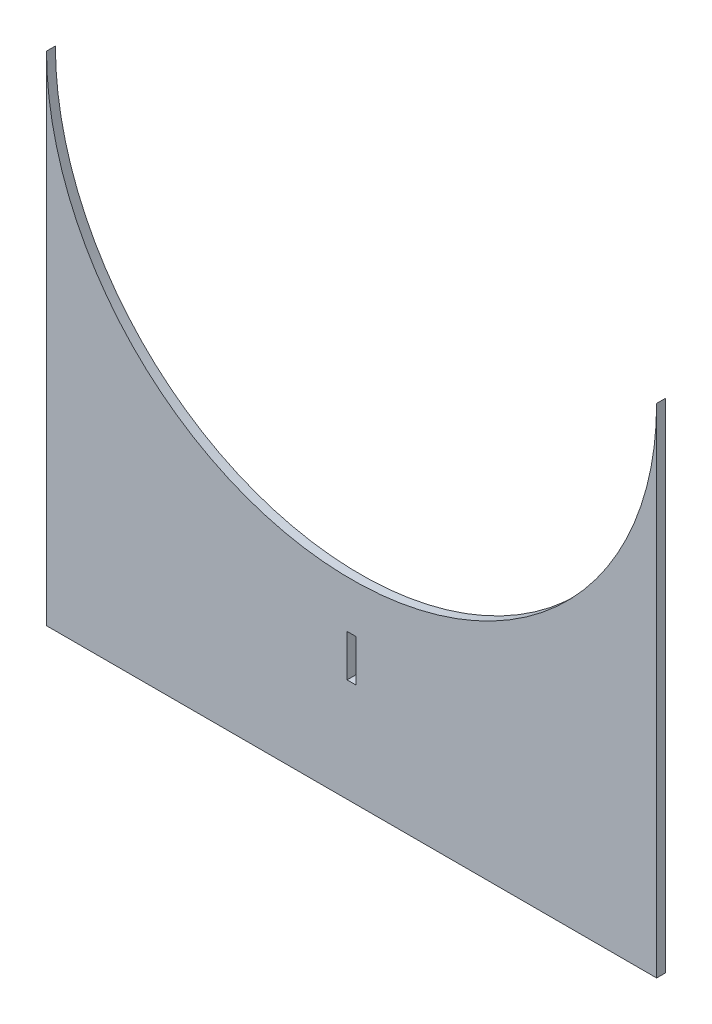
ISO-10303-21;
HEADER;
FILE_DESCRIPTION(('STEP AP214'),'2;1');
FILE_NAME('part.step','',(''),(''),'','','');
FILE_SCHEMA(('AUTOMOTIVE_DESIGN { 1 0 10303 214 1 1 1 1 }'));
ENDSEC;
DATA;
#1=APPLICATION_CONTEXT('core data for automotive mechanical design processes');
#2=APPLICATION_PROTOCOL_DEFINITION('international standard','automotive_design',2000,#1);
#3=PRODUCT_CONTEXT('',#1,'mechanical');
#4=PRODUCT('Part','Part','',(#3));
#5=PRODUCT_RELATED_PRODUCT_CATEGORY('part','',(#4));
#6=PRODUCT_DEFINITION_FORMATION('','',#4);
#7=PRODUCT_DEFINITION_CONTEXT('part definition',#1,'design');
#8=PRODUCT_DEFINITION('design','',#6,#7);
#9=PRODUCT_DEFINITION_SHAPE('','',#8);
#10=(LENGTH_UNIT() NAMED_UNIT(*) SI_UNIT(.MILLI.,.METRE.));
#11=(NAMED_UNIT(*) PLANE_ANGLE_UNIT() SI_UNIT($,.RADIAN.));
#12=(NAMED_UNIT(*) SI_UNIT($,.STERADIAN.) SOLID_ANGLE_UNIT());
#13=UNCERTAINTY_MEASURE_WITH_UNIT(LENGTH_MEASURE(1.E-05),#10,'distance_accuracy_value','');
#14=(GEOMETRIC_REPRESENTATION_CONTEXT(3) GLOBAL_UNCERTAINTY_ASSIGNED_CONTEXT((#13)) GLOBAL_UNIT_ASSIGNED_CONTEXT((#10,
#11,#12)) REPRESENTATION_CONTEXT('',''));
#15=CARTESIAN_POINT('',(0.,0.,0.));
#16=DIRECTION('',(0.,0.,1.));
#17=DIRECTION('',(1.,0.,0.));
#18=AXIS2_PLACEMENT_3D('',#15,#16,#17);
#19=CARTESIAN_POINT('',(0.,88.9,3.175));
#20=DIRECTION('',(0.,0.,-1.));
#21=DIRECTION('',(-1.,0.,0.));
#22=AXIS2_PLACEMENT_3D('',#19,#20,#21);
#23=CYLINDRICAL_SURFACE('',#22,109.);
#24=CARTESIAN_POINT('',(0.,88.9,0.));
#25=DIRECTION('',(0.,0.,1.));
#26=DIRECTION('',(1.,0.,0.));
#27=AXIS2_PLACEMENT_3D('',#24,#25,#26);
#28=CIRCLE('',#27,109.);
#29=CARTESIAN_POINT('',(-109.,88.9,0.));
#30=VERTEX_POINT('',#29);
#31=CARTESIAN_POINT('',(109.,88.9,0.));
#32=VERTEX_POINT('',#31);
#33=EDGE_CURVE('E148',#30,#32,#28,.T.);
#34=ORIENTED_EDGE('',*,*,#33,.F.);
#35=DIRECTION('',(0.,0.,-1.));
#36=VECTOR('',#35,1.);
#37=CARTESIAN_POINT('',(-109.,88.9,3.175));
#38=LINE('',#37,#36);
#39=CARTESIAN_POINT('',(-109.,88.9,3.175));
#40=VERTEX_POINT('',#39);
#41=EDGE_CURVE('E11',#40,#30,#38,.T.);
#42=ORIENTED_EDGE('',*,*,#41,.F.);
#43=CARTESIAN_POINT('',(0.,88.9,3.175));
#44=DIRECTION('',(0.,0.,1.));
#45=DIRECTION('',(1.,0.,0.));
#46=AXIS2_PLACEMENT_3D('',#43,#44,#45);
#47=CIRCLE('',#46,109.);
#48=CARTESIAN_POINT('',(109.,88.9,3.175));
#49=VERTEX_POINT('',#48);
#50=EDGE_CURVE('E154',#40,#49,#47,.T.);
#51=ORIENTED_EDGE('',*,*,#50,.T.);
#52=DIRECTION('',(0.,0.,-1.));
#53=VECTOR('',#52,1.);
#54=CARTESIAN_POINT('',(109.,88.9,3.175));
#55=LINE('',#54,#53);
#56=EDGE_CURVE('E169',#49,#32,#55,.T.);
#57=ORIENTED_EDGE('',*,*,#56,.T.);
#58=EDGE_LOOP('',(#34,#42,#51,#57));
#59=FACE_BOUND('',#58,.T.);
#60=ADVANCED_FACE('F41',(#59),#23,.F.);
#61=CARTESIAN_POINT('',(-109.,0.,3.175));
#62=DIRECTION('',(-1.,0.,0.));
#63=DIRECTION('',(0.,0.,1.));
#64=AXIS2_PLACEMENT_3D('',#61,#62,#63);
#65=PLANE('',#64);
#66=DIRECTION('',(0.,1.,0.));
#67=VECTOR('',#66,1.);
#68=CARTESIAN_POINT('',(-109.,0.,0.));
#69=LINE('',#68,#67);
#70=CARTESIAN_POINT('',(-109.,-88.9,0.));
#71=VERTEX_POINT('',#70);
#72=EDGE_CURVE('E173',#71,#30,#69,.T.);
#73=ORIENTED_EDGE('',*,*,#72,.F.);
#74=DIRECTION('',(0.,0.,-1.));
#75=VECTOR('',#74,1.);
#76=CARTESIAN_POINT('',(-109.,-88.9,3.175));
#77=LINE('',#76,#75);
#78=CARTESIAN_POINT('',(-109.,-88.9,3.175));
#79=VERTEX_POINT('',#78);
#80=EDGE_CURVE('E49',#79,#71,#77,.T.);
#81=ORIENTED_EDGE('',*,*,#80,.F.);
#82=DIRECTION('',(0.,1.,0.));
#83=VECTOR('',#82,1.);
#84=CARTESIAN_POINT('',(-109.,0.,3.175));
#85=LINE('',#84,#83);
#86=EDGE_CURVE('E158',#79,#40,#85,.T.);
#87=ORIENTED_EDGE('',*,*,#86,.T.);
#88=ORIENTED_EDGE('',*,*,#41,.T.);
#89=EDGE_LOOP('',(#73,#81,#87,#88));
#90=FACE_BOUND('',#89,.T.);
#91=ADVANCED_FACE('F200',(#90),#65,.T.);
#92=CARTESIAN_POINT('',(0.,-88.9,3.175));
#93=DIRECTION('',(0.,1.,0.));
#94=DIRECTION('',(0.,0.,1.));
#95=AXIS2_PLACEMENT_3D('',#92,#93,#94);
#96=PLANE('',#95);
#97=DIRECTION('',(1.,0.,0.));
#98=VECTOR('',#97,1.);
#99=CARTESIAN_POINT('',(0.,-88.9,0.));
#100=LINE('',#99,#98);
#101=CARTESIAN_POINT('',(109.,-88.9,0.));
#102=VERTEX_POINT('',#101);
#103=EDGE_CURVE('E177',#71,#102,#100,.T.);
#104=ORIENTED_EDGE('',*,*,#103,.T.);
#105=DIRECTION('',(0.,0.,-1.));
#106=VECTOR('',#105,1.);
#107=CARTESIAN_POINT('',(109.,-88.9,3.175));
#108=LINE('',#107,#106);
#109=CARTESIAN_POINT('',(109.,-88.9,3.175));
#110=VERTEX_POINT('',#109);
#111=EDGE_CURVE('E185',#110,#102,#108,.T.);
#112=ORIENTED_EDGE('',*,*,#111,.F.);
#113=DIRECTION('',(1.,0.,0.));
#114=VECTOR('',#113,1.);
#115=CARTESIAN_POINT('',(0.,-88.9,3.175));
#116=LINE('',#115,#114);
#117=EDGE_CURVE('E163',#79,#110,#116,.T.);
#118=ORIENTED_EDGE('',*,*,#117,.F.);
#119=ORIENTED_EDGE('',*,*,#80,.T.);
#120=EDGE_LOOP('',(#104,#112,#118,#119));
#121=FACE_BOUND('',#120,.T.);
#122=ADVANCED_FACE('F192',(#121),#96,.F.);
#123=CARTESIAN_POINT('',(109.,0.,3.175));
#124=DIRECTION('',(-1.,0.,0.));
#125=DIRECTION('',(0.,0.,1.));
#126=AXIS2_PLACEMENT_3D('',#123,#124,#125);
#127=PLANE('',#126);
#128=DIRECTION('',(0.,1.,0.));
#129=VECTOR('',#128,1.);
#130=CARTESIAN_POINT('',(109.,0.,0.));
#131=LINE('',#130,#129);
#132=EDGE_CURVE('E159',#102,#32,#131,.T.);
#133=ORIENTED_EDGE('',*,*,#132,.T.);
#134=ORIENTED_EDGE('',*,*,#56,.F.);
#135=DIRECTION('',(0.,1.,0.));
#136=VECTOR('',#135,1.);
#137=CARTESIAN_POINT('',(109.,0.,3.175));
#138=LINE('',#137,#136);
#139=EDGE_CURVE('E166',#110,#49,#138,.T.);
#140=ORIENTED_EDGE('',*,*,#139,.F.);
#141=ORIENTED_EDGE('',*,*,#111,.T.);
#142=EDGE_LOOP('',(#133,#134,#140,#141));
#143=FACE_BOUND('',#142,.T.);
#144=ADVANCED_FACE('F207',(#143),#127,.F.);
#145=CARTESIAN_POINT('',(0.,0.,3.175));
#146=DIRECTION('',(0.,0.,1.));
#147=DIRECTION('',(1.,0.,0.));
#148=AXIS2_PLACEMENT_3D('',#145,#146,#147);
#149=PLANE('',#148);
#150=DIRECTION('',(0.,1.,0.));
#151=VECTOR('',#150,1.);
#152=CARTESIAN_POINT('',(-1.58750000000001,-36.95,3.175));
#153=LINE('',#152,#151);
#154=CARTESIAN_POINT('',(-1.58750000000001,-51.95,3.175));
#155=VERTEX_POINT('',#154);
#156=CARTESIAN_POINT('',(-1.58750000000001,-36.95,3.175));
#157=VERTEX_POINT('',#156);
#158=EDGE_CURVE('E107',#155,#157,#153,.T.);
#159=ORIENTED_EDGE('',*,*,#158,.T.);
#160=DIRECTION('',(1.,0.,0.));
#161=VECTOR('',#160,1.);
#162=CARTESIAN_POINT('',(1.58749999999999,-36.95,3.175));
#163=LINE('',#162,#161);
#164=CARTESIAN_POINT('',(1.58749999999999,-36.95,3.175));
#165=VERTEX_POINT('',#164);
#166=EDGE_CURVE('E117',#157,#165,#163,.T.);
#167=ORIENTED_EDGE('',*,*,#166,.T.);
#168=DIRECTION('',(0.,-1.,0.));
#169=VECTOR('',#168,1.);
#170=CARTESIAN_POINT('',(1.58749999999999,-36.95,3.175));
#171=LINE('',#170,#169);
#172=CARTESIAN_POINT('',(1.58749999999999,-51.95,3.175));
#173=VERTEX_POINT('',#172);
#174=EDGE_CURVE('E56',#165,#173,#171,.T.);
#175=ORIENTED_EDGE('',*,*,#174,.T.);
#176=DIRECTION('',(-1.,0.,0.));
#177=VECTOR('',#176,1.);
#178=CARTESIAN_POINT('',(1.58749999999999,-51.95,3.175));
#179=LINE('',#178,#177);
#180=EDGE_CURVE('E114',#173,#155,#179,.T.);
#181=ORIENTED_EDGE('',*,*,#180,.T.);
#182=EDGE_LOOP('',(#159,#167,#175,#181));
#183=FACE_BOUND('',#182,.T.);
#184=ORIENTED_EDGE('',*,*,#50,.F.);
#185=ORIENTED_EDGE('',*,*,#86,.F.);
#186=ORIENTED_EDGE('',*,*,#117,.T.);
#187=ORIENTED_EDGE('',*,*,#139,.T.);
#188=EDGE_LOOP('',(#184,#185,#186,#187));
#189=FACE_BOUND('',#188,.T.);
#190=ADVANCED_FACE('F122',(#183,#189),#149,.T.);
#191=CARTESIAN_POINT('',(0.,0.,0.));
#192=DIRECTION('',(0.,0.,1.));
#193=DIRECTION('',(1.,0.,0.));
#194=AXIS2_PLACEMENT_3D('',#191,#192,#193);
#195=PLANE('',#194);
#196=DIRECTION('',(1.,0.,0.));
#197=VECTOR('',#196,1.);
#198=CARTESIAN_POINT('',(1.58749999999999,-36.95,0.));
#199=LINE('',#198,#197);
#200=CARTESIAN_POINT('',(-1.58750000000001,-36.95,0.));
#201=VERTEX_POINT('',#200);
#202=CARTESIAN_POINT('',(1.58749999999999,-36.95,0.));
#203=VERTEX_POINT('',#202);
#204=EDGE_CURVE('E139',#201,#203,#199,.T.);
#205=ORIENTED_EDGE('',*,*,#204,.F.);
#206=DIRECTION('',(0.,1.,0.));
#207=VECTOR('',#206,1.);
#208=CARTESIAN_POINT('',(-1.58750000000001,-36.95,0.));
#209=LINE('',#208,#207);
#210=CARTESIAN_POINT('',(-1.58750000000001,-51.95,0.));
#211=VERTEX_POINT('',#210);
#212=EDGE_CURVE('E64',#211,#201,#209,.T.);
#213=ORIENTED_EDGE('',*,*,#212,.F.);
#214=DIRECTION('',(-1.,0.,0.));
#215=VECTOR('',#214,1.);
#216=CARTESIAN_POINT('',(1.58749999999999,-51.95,0.));
#217=LINE('',#216,#215);
#218=CARTESIAN_POINT('',(1.58749999999999,-51.95,0.));
#219=VERTEX_POINT('',#218);
#220=EDGE_CURVE('E126',#219,#211,#217,.T.);
#221=ORIENTED_EDGE('',*,*,#220,.F.);
#222=DIRECTION('',(0.,-1.,0.));
#223=VECTOR('',#222,1.);
#224=CARTESIAN_POINT('',(1.58749999999999,-36.95,0.));
#225=LINE('',#224,#223);
#226=EDGE_CURVE('E130',#203,#219,#225,.T.);
#227=ORIENTED_EDGE('',*,*,#226,.F.);
#228=EDGE_LOOP('',(#205,#213,#221,#227));
#229=FACE_BOUND('',#228,.T.);
#230=ORIENTED_EDGE('',*,*,#33,.T.);
#231=ORIENTED_EDGE('',*,*,#132,.F.);
#232=ORIENTED_EDGE('',*,*,#103,.F.);
#233=ORIENTED_EDGE('',*,*,#72,.T.);
#234=EDGE_LOOP('',(#230,#231,#232,#233));
#235=FACE_BOUND('',#234,.T.);
#236=ADVANCED_FACE('F199',(#229,#235),#195,.F.);
#237=CARTESIAN_POINT('',(-1.58750000000001,-36.95,3.175));
#238=DIRECTION('',(-1.,0.,0.));
#239=DIRECTION('',(0.,-1.,0.));
#240=AXIS2_PLACEMENT_3D('',#237,#238,#239);
#241=PLANE('',#240);
#242=ORIENTED_EDGE('',*,*,#212,.T.);
#243=DIRECTION('',(0.,0.,-1.));
#244=VECTOR('',#243,1.);
#245=CARTESIAN_POINT('',(-1.58750000000001,-36.95,3.175));
#246=LINE('',#245,#244);
#247=EDGE_CURVE('E103',#157,#201,#246,.T.);
#248=ORIENTED_EDGE('',*,*,#247,.F.);
#249=ORIENTED_EDGE('',*,*,#158,.F.);
#250=DIRECTION('',(0.,0.,-1.));
#251=VECTOR('',#250,1.);
#252=CARTESIAN_POINT('',(-1.58750000000001,-51.95,3.175));
#253=LINE('',#252,#251);
#254=EDGE_CURVE('E145',#155,#211,#253,.T.);
#255=ORIENTED_EDGE('',*,*,#254,.T.);
#256=EDGE_LOOP('',(#242,#248,#249,#255));
#257=FACE_BOUND('',#256,.T.);
#258=ADVANCED_FACE('F105',(#257),#241,.F.);
#259=CARTESIAN_POINT('',(1.58749999999999,-51.95,3.175));
#260=DIRECTION('',(0.,-1.,0.));
#261=DIRECTION('',(0.,0.,-1.));
#262=AXIS2_PLACEMENT_3D('',#259,#260,#261);
#263=PLANE('',#262);
#264=ORIENTED_EDGE('',*,*,#220,.T.);
#265=ORIENTED_EDGE('',*,*,#254,.F.);
#266=ORIENTED_EDGE('',*,*,#180,.F.);
#267=DIRECTION('',(0.,0.,-1.));
#268=VECTOR('',#267,1.);
#269=CARTESIAN_POINT('',(1.58749999999999,-51.95,3.175));
#270=LINE('',#269,#268);
#271=EDGE_CURVE('E149',#173,#219,#270,.T.);
#272=ORIENTED_EDGE('',*,*,#271,.T.);
#273=EDGE_LOOP('',(#264,#265,#266,#272));
#274=FACE_BOUND('',#273,.T.);
#275=ADVANCED_FACE('F251',(#274),#263,.F.);
#276=CARTESIAN_POINT('',(1.58749999999999,-36.95,3.175));
#277=DIRECTION('',(1.,0.,0.));
#278=DIRECTION('',(0.,1.,0.));
#279=AXIS2_PLACEMENT_3D('',#276,#277,#278);
#280=PLANE('',#279);
#281=ORIENTED_EDGE('',*,*,#226,.T.);
#282=ORIENTED_EDGE('',*,*,#271,.F.);
#283=ORIENTED_EDGE('',*,*,#174,.F.);
#284=DIRECTION('',(0.,0.,-1.));
#285=VECTOR('',#284,1.);
#286=CARTESIAN_POINT('',(1.58749999999999,-36.95,3.175));
#287=LINE('',#286,#285);
#288=EDGE_CURVE('E113',#165,#203,#287,.T.);
#289=ORIENTED_EDGE('',*,*,#288,.T.);
#290=EDGE_LOOP('',(#281,#282,#283,#289));
#291=FACE_BOUND('',#290,.T.);
#292=ADVANCED_FACE('F259',(#291),#280,.F.);
#293=CARTESIAN_POINT('',(1.58749999999999,-36.95,3.175));
#294=DIRECTION('',(0.,1.,0.));
#295=DIRECTION('',(0.,0.,1.));
#296=AXIS2_PLACEMENT_3D('',#293,#294,#295);
#297=PLANE('',#296);
#298=ORIENTED_EDGE('',*,*,#204,.T.);
#299=ORIENTED_EDGE('',*,*,#288,.F.);
#300=ORIENTED_EDGE('',*,*,#166,.F.);
#301=ORIENTED_EDGE('',*,*,#247,.T.);
#302=EDGE_LOOP('',(#298,#299,#300,#301));
#303=FACE_BOUND('',#302,.T.);
#304=ADVANCED_FACE('F118',(#303),#297,.F.);
#305=CLOSED_SHELL('',(#60,#91,#122,#144,#190,#236,#258,#275,#292,#304));
#306=MANIFOLD_SOLID_BREP('B2',#305);
#307=ADVANCED_BREP_SHAPE_REPRESENTATION('',(#18,#306),#14);
#308=SHAPE_DEFINITION_REPRESENTATION(#9,#307);
ENDSEC;
END-ISO-10303-21;
